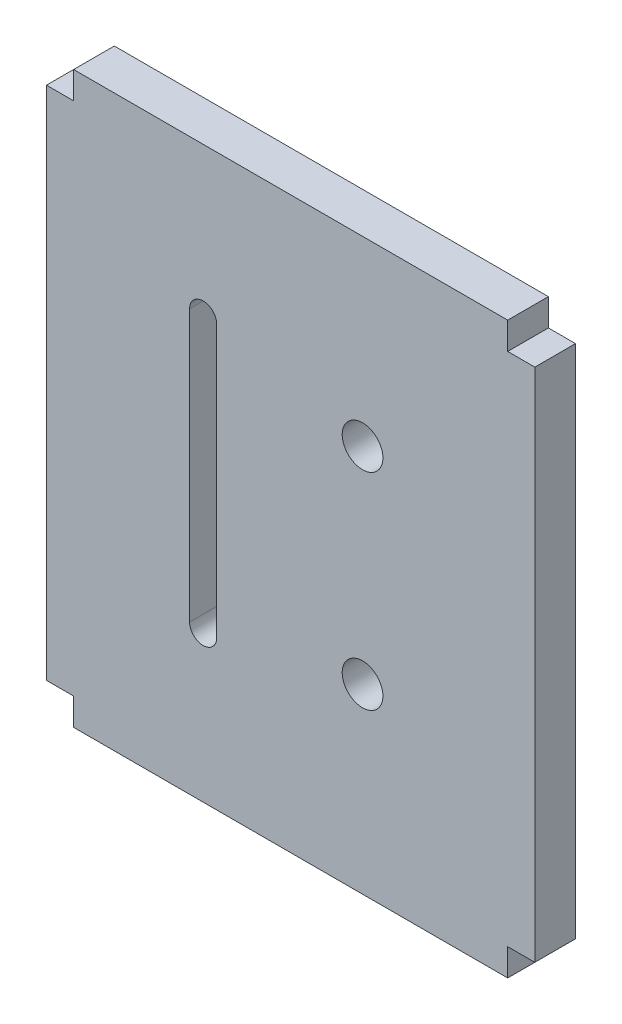
ISO-10303-21;
HEADER;
FILE_DESCRIPTION(('STEP AP214'),'2;1');
FILE_NAME('part.step','',(''),(''),'','','');
FILE_SCHEMA(('AUTOMOTIVE_DESIGN { 1 0 10303 214 1 1 1 1 }'));
ENDSEC;
DATA;
#1=APPLICATION_CONTEXT('core data for automotive mechanical design processes');
#2=APPLICATION_PROTOCOL_DEFINITION('international standard','automotive_design',2000,#1);
#3=PRODUCT_CONTEXT('',#1,'mechanical');
#4=PRODUCT('Part','Part','',(#3));
#5=PRODUCT_RELATED_PRODUCT_CATEGORY('part','',(#4));
#6=PRODUCT_DEFINITION_FORMATION('','',#4);
#7=PRODUCT_DEFINITION_CONTEXT('part definition',#1,'design');
#8=PRODUCT_DEFINITION('design','',#6,#7);
#9=PRODUCT_DEFINITION_SHAPE('','',#8);
#10=(LENGTH_UNIT() NAMED_UNIT(*) SI_UNIT(.MILLI.,.METRE.));
#11=(NAMED_UNIT(*) PLANE_ANGLE_UNIT() SI_UNIT($,.RADIAN.));
#12=(NAMED_UNIT(*) SI_UNIT($,.STERADIAN.) SOLID_ANGLE_UNIT());
#13=UNCERTAINTY_MEASURE_WITH_UNIT(LENGTH_MEASURE(1.E-05),#10,'distance_accuracy_value','');
#14=(GEOMETRIC_REPRESENTATION_CONTEXT(3) GLOBAL_UNCERTAINTY_ASSIGNED_CONTEXT((#13)) GLOBAL_UNIT_ASSIGNED_CONTEXT((#10,
#11,#12)) REPRESENTATION_CONTEXT('',''));
#15=CARTESIAN_POINT('',(0.,0.,0.));
#16=DIRECTION('',(0.,0.,1.));
#17=DIRECTION('',(1.,0.,0.));
#18=AXIS2_PLACEMENT_3D('',#15,#16,#17);
#19=CARTESIAN_POINT('',(-16.,0.,3.));
#20=DIRECTION('',(-1.,0.,0.));
#21=DIRECTION('',(0.,0.,1.));
#22=AXIS2_PLACEMENT_3D('',#19,#20,#21);
#23=PLANE('',#22);
#24=DIRECTION('',(0.,1.,0.));
#25=VECTOR('',#24,1.);
#26=CARTESIAN_POINT('',(-16.,0.,0.));
#27=LINE('',#26,#25);
#28=CARTESIAN_POINT('',(-16.,-21.,0.));
#29=VERTEX_POINT('',#28);
#30=CARTESIAN_POINT('',(-16.,-19.,0.));
#31=VERTEX_POINT('',#30);
#32=EDGE_CURVE('E218',#29,#31,#27,.T.);
#33=ORIENTED_EDGE('',*,*,#32,.F.);
#34=DIRECTION('',(0.,0.,-1.));
#35=VECTOR('',#34,1.);
#36=CARTESIAN_POINT('',(-16.,-21.,3.));
#37=LINE('',#36,#35);
#38=CARTESIAN_POINT('',(-16.,-21.,3.));
#39=VERTEX_POINT('',#38);
#40=EDGE_CURVE('E272',#39,#29,#37,.T.);
#41=ORIENTED_EDGE('',*,*,#40,.F.);
#42=DIRECTION('',(0.,1.,0.));
#43=VECTOR('',#42,1.);
#44=CARTESIAN_POINT('',(-16.,0.,3.));
#45=LINE('',#44,#43);
#46=CARTESIAN_POINT('',(-16.,-19.,3.));
#47=VERTEX_POINT('',#46);
#48=EDGE_CURVE('E187',#39,#47,#45,.T.);
#49=ORIENTED_EDGE('',*,*,#48,.T.);
#50=DIRECTION('',(0.,0.,-1.));
#51=VECTOR('',#50,1.);
#52=CARTESIAN_POINT('',(-16.,-19.,3.));
#53=LINE('',#52,#51);
#54=EDGE_CURVE('E217',#47,#31,#53,.T.);
#55=ORIENTED_EDGE('',*,*,#54,.T.);
#56=EDGE_LOOP('',(#33,#41,#49,#55));
#57=FACE_BOUND('',#56,.T.);
#58=ADVANCED_FACE('F39',(#57),#23,.T.);
#59=CARTESIAN_POINT('',(0.,-21.,3.));
#60=DIRECTION('',(0.,-1.,0.));
#61=DIRECTION('',(0.,0.,-1.));
#62=AXIS2_PLACEMENT_3D('',#59,#60,#61);
#63=PLANE('',#62);
#64=DIRECTION('',(-1.,0.,0.));
#65=VECTOR('',#64,1.);
#66=CARTESIAN_POINT('',(0.,-21.,0.));
#67=LINE('',#66,#65);
#68=CARTESIAN_POINT('',(16.,-21.,0.));
#69=VERTEX_POINT('',#68);
#70=EDGE_CURVE('E221',#69,#29,#67,.T.);
#71=ORIENTED_EDGE('',*,*,#70,.F.);
#72=DIRECTION('',(0.,0.,-1.));
#73=VECTOR('',#72,1.);
#74=CARTESIAN_POINT('',(16.,-21.,3.));
#75=LINE('',#74,#73);
#76=CARTESIAN_POINT('',(16.,-21.,3.));
#77=VERTEX_POINT('',#76);
#78=EDGE_CURVE('E270',#77,#69,#75,.T.);
#79=ORIENTED_EDGE('',*,*,#78,.F.);
#80=DIRECTION('',(-1.,0.,0.));
#81=VECTOR('',#80,1.);
#82=CARTESIAN_POINT('',(0.,-21.,3.));
#83=LINE('',#82,#81);
#84=EDGE_CURVE('E190',#77,#39,#83,.T.);
#85=ORIENTED_EDGE('',*,*,#84,.T.);
#86=ORIENTED_EDGE('',*,*,#40,.T.);
#87=EDGE_LOOP('',(#71,#79,#85,#86));
#88=FACE_BOUND('',#87,.T.);
#89=ADVANCED_FACE('F41',(#88),#63,.T.);
#90=CARTESIAN_POINT('',(16.,0.,3.));
#91=DIRECTION('',(-1.,0.,0.));
#92=DIRECTION('',(0.,0.,1.));
#93=AXIS2_PLACEMENT_3D('',#90,#91,#92);
#94=PLANE('',#93);
#95=DIRECTION('',(0.,1.,0.));
#96=VECTOR('',#95,1.);
#97=CARTESIAN_POINT('',(16.,0.,0.));
#98=LINE('',#97,#96);
#99=CARTESIAN_POINT('',(16.,-19.,0.));
#100=VERTEX_POINT('',#99);
#101=EDGE_CURVE('E225',#69,#100,#98,.T.);
#102=ORIENTED_EDGE('',*,*,#101,.T.);
#103=DIRECTION('',(0.,0.,-1.));
#104=VECTOR('',#103,1.);
#105=CARTESIAN_POINT('',(16.,-19.,3.));
#106=LINE('',#105,#104);
#107=CARTESIAN_POINT('',(16.,-19.,3.));
#108=VERTEX_POINT('',#107);
#109=EDGE_CURVE('E267',#108,#100,#106,.T.);
#110=ORIENTED_EDGE('',*,*,#109,.F.);
#111=DIRECTION('',(0.,1.,0.));
#112=VECTOR('',#111,1.);
#113=CARTESIAN_POINT('',(16.,0.,3.));
#114=LINE('',#113,#112);
#115=EDGE_CURVE('E196',#77,#108,#114,.T.);
#116=ORIENTED_EDGE('',*,*,#115,.F.);
#117=ORIENTED_EDGE('',*,*,#78,.T.);
#118=EDGE_LOOP('',(#102,#110,#116,#117));
#119=FACE_BOUND('',#118,.T.);
#120=ADVANCED_FACE('F305',(#119),#94,.F.);
#121=CARTESIAN_POINT('',(0.,-19.,3.));
#122=DIRECTION('',(0.,1.,0.));
#123=DIRECTION('',(0.,0.,1.));
#124=AXIS2_PLACEMENT_3D('',#121,#122,#123);
#125=PLANE('',#124);
#126=DIRECTION('',(1.,0.,0.));
#127=VECTOR('',#126,1.);
#128=CARTESIAN_POINT('',(0.,-19.,0.));
#129=LINE('',#128,#127);
#130=CARTESIAN_POINT('',(18.,-19.,0.));
#131=VERTEX_POINT('',#130);
#132=EDGE_CURVE('E227',#100,#131,#129,.T.);
#133=ORIENTED_EDGE('',*,*,#132,.T.);
#134=DIRECTION('',(0.,0.,-1.));
#135=VECTOR('',#134,1.);
#136=CARTESIAN_POINT('',(18.,-19.,3.));
#137=LINE('',#136,#135);
#138=CARTESIAN_POINT('',(18.,-19.,3.));
#139=VERTEX_POINT('',#138);
#140=EDGE_CURVE('E265',#139,#131,#137,.T.);
#141=ORIENTED_EDGE('',*,*,#140,.F.);
#142=DIRECTION('',(1.,0.,0.));
#143=VECTOR('',#142,1.);
#144=CARTESIAN_POINT('',(0.,-19.,3.));
#145=LINE('',#144,#143);
#146=EDGE_CURVE('E198',#108,#139,#145,.T.);
#147=ORIENTED_EDGE('',*,*,#146,.F.);
#148=ORIENTED_EDGE('',*,*,#109,.T.);
#149=EDGE_LOOP('',(#133,#141,#147,#148));
#150=FACE_BOUND('',#149,.T.);
#151=ADVANCED_FACE('F357',(#150),#125,.F.);
#152=CARTESIAN_POINT('',(18.,0.,3.));
#153=DIRECTION('',(1.,0.,0.));
#154=DIRECTION('',(0.,0.,-1.));
#155=AXIS2_PLACEMENT_3D('',#152,#153,#154);
#156=PLANE('',#155);
#157=DIRECTION('',(0.,-1.,0.));
#158=VECTOR('',#157,1.);
#159=CARTESIAN_POINT('',(18.,0.,0.));
#160=LINE('',#159,#158);
#161=CARTESIAN_POINT('',(18.,19.,0.));
#162=VERTEX_POINT('',#161);
#163=EDGE_CURVE('E231',#162,#131,#160,.T.);
#164=ORIENTED_EDGE('',*,*,#163,.F.);
#165=DIRECTION('',(0.,0.,-1.));
#166=VECTOR('',#165,1.);
#167=CARTESIAN_POINT('',(18.,19.,3.));
#168=LINE('',#167,#166);
#169=CARTESIAN_POINT('',(18.,19.,3.));
#170=VERTEX_POINT('',#169);
#171=EDGE_CURVE('E263',#170,#162,#168,.T.);
#172=ORIENTED_EDGE('',*,*,#171,.F.);
#173=DIRECTION('',(0.,-1.,0.));
#174=VECTOR('',#173,1.);
#175=CARTESIAN_POINT('',(18.,0.,3.));
#176=LINE('',#175,#174);
#177=EDGE_CURVE('E201',#170,#139,#176,.T.);
#178=ORIENTED_EDGE('',*,*,#177,.T.);
#179=ORIENTED_EDGE('',*,*,#140,.T.);
#180=EDGE_LOOP('',(#164,#172,#178,#179));
#181=FACE_BOUND('',#180,.T.);
#182=ADVANCED_FACE('F351',(#181),#156,.T.);
#183=CARTESIAN_POINT('',(0.,19.,3.));
#184=DIRECTION('',(0.,1.,0.));
#185=DIRECTION('',(0.,0.,1.));
#186=AXIS2_PLACEMENT_3D('',#183,#184,#185);
#187=PLANE('',#186);
#188=DIRECTION('',(1.,0.,0.));
#189=VECTOR('',#188,1.);
#190=CARTESIAN_POINT('',(0.,19.,0.));
#191=LINE('',#190,#189);
#192=CARTESIAN_POINT('',(16.,19.,0.));
#193=VERTEX_POINT('',#192);
#194=EDGE_CURVE('E235',#193,#162,#191,.T.);
#195=ORIENTED_EDGE('',*,*,#194,.F.);
#196=DIRECTION('',(0.,0.,-1.));
#197=VECTOR('',#196,1.);
#198=CARTESIAN_POINT('',(16.,19.,3.));
#199=LINE('',#198,#197);
#200=CARTESIAN_POINT('',(16.,19.,3.));
#201=VERTEX_POINT('',#200);
#202=EDGE_CURVE('E261',#201,#193,#199,.T.);
#203=ORIENTED_EDGE('',*,*,#202,.F.);
#204=DIRECTION('',(1.,0.,0.));
#205=VECTOR('',#204,1.);
#206=CARTESIAN_POINT('',(0.,19.,3.));
#207=LINE('',#206,#205);
#208=EDGE_CURVE('E204',#201,#170,#207,.T.);
#209=ORIENTED_EDGE('',*,*,#208,.T.);
#210=ORIENTED_EDGE('',*,*,#171,.T.);
#211=EDGE_LOOP('',(#195,#203,#209,#210));
#212=FACE_BOUND('',#211,.T.);
#213=ADVANCED_FACE('F347',(#212),#187,.T.);
#214=CARTESIAN_POINT('',(16.,21.,0.));
#215=VERTEX_POINT('',#214);
#216=EDGE_CURVE('E228',#193,#215,#98,.T.);
#217=ORIENTED_EDGE('',*,*,#216,.T.);
#218=DIRECTION('',(0.,0.,-1.));
#219=VECTOR('',#218,1.);
#220=CARTESIAN_POINT('',(16.,21.,3.));
#221=LINE('',#220,#219);
#222=CARTESIAN_POINT('',(16.,21.,3.));
#223=VERTEX_POINT('',#222);
#224=EDGE_CURVE('E258',#223,#215,#221,.T.);
#225=ORIENTED_EDGE('',*,*,#224,.F.);
#226=EDGE_CURVE('E199',#201,#223,#114,.T.);
#227=ORIENTED_EDGE('',*,*,#226,.F.);
#228=ORIENTED_EDGE('',*,*,#202,.T.);
#229=EDGE_LOOP('',(#217,#225,#227,#228));
#230=FACE_BOUND('',#229,.T.);
#231=ADVANCED_FACE('F320',(#230),#94,.F.);
#232=CARTESIAN_POINT('',(0.,21.,3.));
#233=DIRECTION('',(0.,-1.,0.));
#234=DIRECTION('',(0.,0.,-1.));
#235=AXIS2_PLACEMENT_3D('',#232,#233,#234);
#236=PLANE('',#235);
#237=DIRECTION('',(-1.,0.,0.));
#238=VECTOR('',#237,1.);
#239=CARTESIAN_POINT('',(0.,21.,0.));
#240=LINE('',#239,#238);
#241=CARTESIAN_POINT('',(-16.,21.,0.));
#242=VERTEX_POINT('',#241);
#243=EDGE_CURVE('E238',#215,#242,#240,.T.);
#244=ORIENTED_EDGE('',*,*,#243,.T.);
#245=DIRECTION('',(0.,0.,-1.));
#246=VECTOR('',#245,1.);
#247=CARTESIAN_POINT('',(-16.,21.,3.));
#248=LINE('',#247,#246);
#249=CARTESIAN_POINT('',(-16.,21.,3.));
#250=VERTEX_POINT('',#249);
#251=EDGE_CURVE('E256',#250,#242,#248,.T.);
#252=ORIENTED_EDGE('',*,*,#251,.F.);
#253=DIRECTION('',(-1.,0.,0.));
#254=VECTOR('',#253,1.);
#255=CARTESIAN_POINT('',(0.,21.,3.));
#256=LINE('',#255,#254);
#257=EDGE_CURVE('E207',#223,#250,#256,.T.);
#258=ORIENTED_EDGE('',*,*,#257,.F.);
#259=ORIENTED_EDGE('',*,*,#224,.T.);
#260=EDGE_LOOP('',(#244,#252,#258,#259));
#261=FACE_BOUND('',#260,.T.);
#262=ADVANCED_FACE('F312',(#261),#236,.F.);
#263=CARTESIAN_POINT('',(-16.,19.,0.));
#264=VERTEX_POINT('',#263);
#265=EDGE_CURVE('E222',#264,#242,#27,.T.);
#266=ORIENTED_EDGE('',*,*,#265,.F.);
#267=DIRECTION('',(0.,0.,-1.));
#268=VECTOR('',#267,1.);
#269=CARTESIAN_POINT('',(-16.,19.,3.));
#270=LINE('',#269,#268);
#271=CARTESIAN_POINT('',(-16.,19.,3.));
#272=VERTEX_POINT('',#271);
#273=EDGE_CURVE('E254',#272,#264,#270,.T.);
#274=ORIENTED_EDGE('',*,*,#273,.F.);
#275=EDGE_CURVE('E192',#272,#250,#45,.T.);
#276=ORIENTED_EDGE('',*,*,#275,.T.);
#277=ORIENTED_EDGE('',*,*,#251,.T.);
#278=EDGE_LOOP('',(#266,#274,#276,#277));
#279=FACE_BOUND('',#278,.T.);
#280=ADVANCED_FACE('F301',(#279),#23,.T.);
#281=CARTESIAN_POINT('',(0.,19.,3.));
#282=DIRECTION('',(0.,-1.,0.));
#283=DIRECTION('',(0.,0.,-1.));
#284=AXIS2_PLACEMENT_3D('',#281,#282,#283);
#285=PLANE('',#284);
#286=DIRECTION('',(-1.,0.,0.));
#287=VECTOR('',#286,1.);
#288=CARTESIAN_POINT('',(0.,19.,0.));
#289=LINE('',#288,#287);
#290=CARTESIAN_POINT('',(-18.,19.,0.));
#291=VERTEX_POINT('',#290);
#292=EDGE_CURVE('E241',#264,#291,#289,.T.);
#293=ORIENTED_EDGE('',*,*,#292,.T.);
#294=DIRECTION('',(0.,0.,-1.));
#295=VECTOR('',#294,1.);
#296=CARTESIAN_POINT('',(-18.,19.,3.));
#297=LINE('',#296,#295);
#298=CARTESIAN_POINT('',(-18.,19.,3.));
#299=VERTEX_POINT('',#298);
#300=EDGE_CURVE('E251',#299,#291,#297,.T.);
#301=ORIENTED_EDGE('',*,*,#300,.F.);
#302=DIRECTION('',(-1.,0.,0.));
#303=VECTOR('',#302,1.);
#304=CARTESIAN_POINT('',(0.,19.,3.));
#305=LINE('',#304,#303);
#306=EDGE_CURVE('E210',#272,#299,#305,.T.);
#307=ORIENTED_EDGE('',*,*,#306,.F.);
#308=ORIENTED_EDGE('',*,*,#273,.T.);
#309=EDGE_LOOP('',(#293,#301,#307,#308));
#310=FACE_BOUND('',#309,.T.);
#311=ADVANCED_FACE('F311',(#310),#285,.F.);
#312=CARTESIAN_POINT('',(-18.,0.,3.));
#313=DIRECTION('',(1.,0.,0.));
#314=DIRECTION('',(0.,0.,-1.));
#315=AXIS2_PLACEMENT_3D('',#312,#313,#314);
#316=PLANE('',#315);
#317=DIRECTION('',(0.,-1.,0.));
#318=VECTOR('',#317,1.);
#319=CARTESIAN_POINT('',(-18.,0.,0.));
#320=LINE('',#319,#318);
#321=CARTESIAN_POINT('',(-18.,-19.,0.));
#322=VERTEX_POINT('',#321);
#323=EDGE_CURVE('E243',#291,#322,#320,.T.);
#324=ORIENTED_EDGE('',*,*,#323,.T.);
#325=DIRECTION('',(0.,0.,-1.));
#326=VECTOR('',#325,1.);
#327=CARTESIAN_POINT('',(-18.,-19.,3.));
#328=LINE('',#327,#326);
#329=CARTESIAN_POINT('',(-18.,-19.,3.));
#330=VERTEX_POINT('',#329);
#331=EDGE_CURVE('E249',#330,#322,#328,.T.);
#332=ORIENTED_EDGE('',*,*,#331,.F.);
#333=DIRECTION('',(0.,-1.,0.));
#334=VECTOR('',#333,1.);
#335=CARTESIAN_POINT('',(-18.,0.,3.));
#336=LINE('',#335,#334);
#337=EDGE_CURVE('E212',#299,#330,#336,.T.);
#338=ORIENTED_EDGE('',*,*,#337,.F.);
#339=ORIENTED_EDGE('',*,*,#300,.T.);
#340=EDGE_LOOP('',(#324,#332,#338,#339));
#341=FACE_BOUND('',#340,.T.);
#342=ADVANCED_FACE('F318',(#341),#316,.F.);
#343=CARTESIAN_POINT('',(0.,-19.,3.));
#344=DIRECTION('',(0.,-1.,0.));
#345=DIRECTION('',(0.,0.,-1.));
#346=AXIS2_PLACEMENT_3D('',#343,#344,#345);
#347=PLANE('',#346);
#348=DIRECTION('',(-1.,0.,0.));
#349=VECTOR('',#348,1.);
#350=CARTESIAN_POINT('',(0.,-19.,0.));
#351=LINE('',#350,#349);
#352=EDGE_CURVE('E191',#31,#322,#351,.T.);
#353=ORIENTED_EDGE('',*,*,#352,.F.);
#354=ORIENTED_EDGE('',*,*,#54,.F.);
#355=DIRECTION('',(-1.,0.,0.));
#356=VECTOR('',#355,1.);
#357=CARTESIAN_POINT('',(0.,-19.,3.));
#358=LINE('',#357,#356);
#359=EDGE_CURVE('E214',#47,#330,#358,.T.);
#360=ORIENTED_EDGE('',*,*,#359,.T.);
#361=ORIENTED_EDGE('',*,*,#331,.T.);
#362=EDGE_LOOP('',(#353,#354,#360,#361));
#363=FACE_BOUND('',#362,.T.);
#364=ADVANCED_FACE('F365',(#363),#347,.T.);
#365=CARTESIAN_POINT('',(0.,0.,3.));
#366=DIRECTION('',(0.,0.,1.));
#367=DIRECTION('',(1.,0.,0.));
#368=AXIS2_PLACEMENT_3D('',#365,#366,#367);
#369=PLANE('',#368);
#370=CARTESIAN_POINT('',(5.3,7.59999999999999,3.));
#371=DIRECTION('',(0.,0.,1.));
#372=DIRECTION('',(1.,0.,0.));
#373=AXIS2_PLACEMENT_3D('',#370,#371,#372);
#374=CIRCLE('',#373,1.5);
#375=CARTESIAN_POINT('',(6.8,7.59999999999999,3.));
#376=VERTEX_POINT('',#375);
#377=EDGE_CURVE('E180',#376,#376,#374,.T.);
#378=ORIENTED_EDGE('',*,*,#377,.F.);
#379=EDGE_LOOP('',(#378));
#380=FACE_BOUND('',#379,.T.);
#381=CARTESIAN_POINT('',(-6.45,-10.,3.));
#382=DIRECTION('',(0.,0.,1.));
#383=DIRECTION('',(1.,0.,0.));
#384=AXIS2_PLACEMENT_3D('',#381,#382,#383);
#385=CIRCLE('',#384,1.);
#386=CARTESIAN_POINT('',(-7.45,-10.,3.));
#387=VERTEX_POINT('',#386);
#388=CARTESIAN_POINT('',(-5.45,-10.,3.));
#389=VERTEX_POINT('',#388);
#390=EDGE_CURVE('E55',#387,#389,#385,.T.);
#391=ORIENTED_EDGE('',*,*,#390,.F.);
#392=DIRECTION('',(0.,-1.,0.));
#393=VECTOR('',#392,1.);
#394=CARTESIAN_POINT('',(-7.45,-10.,3.));
#395=LINE('',#394,#393);
#396=CARTESIAN_POINT('',(-7.45,10.,3.));
#397=VERTEX_POINT('',#396);
#398=EDGE_CURVE('E172',#397,#387,#395,.T.);
#399=ORIENTED_EDGE('',*,*,#398,.F.);
#400=CARTESIAN_POINT('',(-6.45,10.,3.));
#401=DIRECTION('',(0.,0.,1.));
#402=DIRECTION('',(1.,0.,0.));
#403=AXIS2_PLACEMENT_3D('',#400,#401,#402);
#404=CIRCLE('',#403,1.);
#405=CARTESIAN_POINT('',(-5.45,10.,3.));
#406=VERTEX_POINT('',#405);
#407=EDGE_CURVE('E156',#406,#397,#404,.T.);
#408=ORIENTED_EDGE('',*,*,#407,.F.);
#409=DIRECTION('',(0.,1.,0.));
#410=VECTOR('',#409,1.);
#411=CARTESIAN_POINT('',(-5.45,-10.,3.));
#412=LINE('',#411,#410);
#413=EDGE_CURVE('E165',#389,#406,#412,.T.);
#414=ORIENTED_EDGE('',*,*,#413,.F.);
#415=EDGE_LOOP('',(#391,#399,#408,#414));
#416=FACE_BOUND('',#415,.T.);
#417=CARTESIAN_POINT('',(5.3,-7.60000000000001,3.));
#418=DIRECTION('',(0.,0.,1.));
#419=DIRECTION('',(1.,0.,0.));
#420=AXIS2_PLACEMENT_3D('',#417,#418,#419);
#421=CIRCLE('',#420,1.5);
#422=CARTESIAN_POINT('',(6.8,-7.60000000000001,3.));
#423=VERTEX_POINT('',#422);
#424=EDGE_CURVE('E183',#423,#423,#421,.T.);
#425=ORIENTED_EDGE('',*,*,#424,.F.);
#426=EDGE_LOOP('',(#425));
#427=FACE_BOUND('',#426,.T.);
#428=ORIENTED_EDGE('',*,*,#48,.F.);
#429=ORIENTED_EDGE('',*,*,#84,.F.);
#430=ORIENTED_EDGE('',*,*,#115,.T.);
#431=ORIENTED_EDGE('',*,*,#146,.T.);
#432=ORIENTED_EDGE('',*,*,#177,.F.);
#433=ORIENTED_EDGE('',*,*,#208,.F.);
#434=ORIENTED_EDGE('',*,*,#226,.T.);
#435=ORIENTED_EDGE('',*,*,#257,.T.);
#436=ORIENTED_EDGE('',*,*,#275,.F.);
#437=ORIENTED_EDGE('',*,*,#306,.T.);
#438=ORIENTED_EDGE('',*,*,#337,.T.);
#439=ORIENTED_EDGE('',*,*,#359,.F.);
#440=EDGE_LOOP('',(#428,#429,#430,#431,#432,#433,#434,#435,#436,#437,#438,#439));
#441=FACE_BOUND('',#440,.T.);
#442=ADVANCED_FACE('F169',(#380,#416,#427,#441),#369,.T.);
#443=CARTESIAN_POINT('',(0.,0.,0.));
#444=DIRECTION('',(0.,0.,1.));
#445=DIRECTION('',(1.,0.,0.));
#446=AXIS2_PLACEMENT_3D('',#443,#444,#445);
#447=PLANE('',#446);
#448=CARTESIAN_POINT('',(5.3,7.59999999999999,0.));
#449=DIRECTION('',(0.,0.,1.));
#450=DIRECTION('',(1.,0.,0.));
#451=AXIS2_PLACEMENT_3D('',#448,#449,#450);
#452=CIRCLE('',#451,1.5);
#453=CARTESIAN_POINT('',(6.8,7.59999999999999,0.));
#454=VERTEX_POINT('',#453);
#455=EDGE_CURVE('E43',#454,#454,#452,.T.);
#456=ORIENTED_EDGE('',*,*,#455,.T.);
#457=EDGE_LOOP('',(#456));
#458=FACE_BOUND('',#457,.T.);
#459=DIRECTION('',(0.,-1.,0.));
#460=VECTOR('',#459,1.);
#461=CARTESIAN_POINT('',(-7.45,0.,0.));
#462=LINE('',#461,#460);
#463=CARTESIAN_POINT('',(-7.45,10.,0.));
#464=VERTEX_POINT('',#463);
#465=CARTESIAN_POINT('',(-7.45,-10.,0.));
#466=VERTEX_POINT('',#465);
#467=EDGE_CURVE('E48',#464,#466,#462,.T.);
#468=ORIENTED_EDGE('',*,*,#467,.T.);
#469=CARTESIAN_POINT('',(-6.45,-10.,0.));
#470=DIRECTION('',(0.,0.,1.));
#471=DIRECTION('',(1.,0.,0.));
#472=AXIS2_PLACEMENT_3D('',#469,#470,#471);
#473=CIRCLE('',#472,1.);
#474=CARTESIAN_POINT('',(-5.45,-10.,0.));
#475=VERTEX_POINT('',#474);
#476=EDGE_CURVE('E11',#466,#475,#473,.T.);
#477=ORIENTED_EDGE('',*,*,#476,.T.);
#478=DIRECTION('',(0.,1.,0.));
#479=VECTOR('',#478,1.);
#480=CARTESIAN_POINT('',(-5.45,0.,0.));
#481=LINE('',#480,#479);
#482=CARTESIAN_POINT('',(-5.45,10.,0.));
#483=VERTEX_POINT('',#482);
#484=EDGE_CURVE('E274',#475,#483,#481,.T.);
#485=ORIENTED_EDGE('',*,*,#484,.T.);
#486=CARTESIAN_POINT('',(-6.45,10.,0.));
#487=DIRECTION('',(0.,0.,1.));
#488=DIRECTION('',(1.,0.,0.));
#489=AXIS2_PLACEMENT_3D('',#486,#487,#488);
#490=CIRCLE('',#489,1.);
#491=EDGE_CURVE('E159',#483,#464,#490,.T.);
#492=ORIENTED_EDGE('',*,*,#491,.T.);
#493=EDGE_LOOP('',(#468,#477,#485,#492));
#494=FACE_BOUND('',#493,.T.);
#495=CARTESIAN_POINT('',(5.3,-7.60000000000001,0.));
#496=DIRECTION('',(0.,0.,1.));
#497=DIRECTION('',(1.,0.,0.));
#498=AXIS2_PLACEMENT_3D('',#495,#496,#497);
#499=CIRCLE('',#498,1.5);
#500=CARTESIAN_POINT('',(6.8,-7.60000000000001,0.));
#501=VERTEX_POINT('',#500);
#502=EDGE_CURVE('E186',#501,#501,#499,.T.);
#503=ORIENTED_EDGE('',*,*,#502,.T.);
#504=EDGE_LOOP('',(#503));
#505=FACE_BOUND('',#504,.T.);
#506=ORIENTED_EDGE('',*,*,#32,.T.);
#507=ORIENTED_EDGE('',*,*,#352,.T.);
#508=ORIENTED_EDGE('',*,*,#323,.F.);
#509=ORIENTED_EDGE('',*,*,#292,.F.);
#510=ORIENTED_EDGE('',*,*,#265,.T.);
#511=ORIENTED_EDGE('',*,*,#243,.F.);
#512=ORIENTED_EDGE('',*,*,#216,.F.);
#513=ORIENTED_EDGE('',*,*,#194,.T.);
#514=ORIENTED_EDGE('',*,*,#163,.T.);
#515=ORIENTED_EDGE('',*,*,#132,.F.);
#516=ORIENTED_EDGE('',*,*,#101,.F.);
#517=ORIENTED_EDGE('',*,*,#70,.T.);
#518=EDGE_LOOP('',(#506,#507,#508,#509,#510,#511,#512,#513,#514,#515,#516,#517));
#519=FACE_BOUND('',#518,.T.);
#520=ADVANCED_FACE('F281',(#458,#494,#505,#519),#447,.F.);
#521=CARTESIAN_POINT('',(5.3,-7.60000000000001,-7.));
#522=DIRECTION('',(0.,0.,1.));
#523=DIRECTION('',(1.,0.,0.));
#524=AXIS2_PLACEMENT_3D('',#521,#522,#523);
#525=CYLINDRICAL_SURFACE('',#524,1.5);
#526=ORIENTED_EDGE('',*,*,#424,.T.);
#527=EDGE_LOOP('',(#526));
#528=FACE_BOUND('',#527,.T.);
#529=ORIENTED_EDGE('',*,*,#502,.F.);
#530=EDGE_LOOP('',(#529));
#531=FACE_BOUND('',#530,.T.);
#532=ADVANCED_FACE('F288',(#528,#531),#525,.F.);
#533=CARTESIAN_POINT('',(-6.45,-10.,-7.));
#534=DIRECTION('',(0.,0.,1.));
#535=DIRECTION('',(1.,0.,0.));
#536=AXIS2_PLACEMENT_3D('',#533,#534,#535);
#537=CYLINDRICAL_SURFACE('',#536,1.);
#538=DIRECTION('',(0.,0.,1.));
#539=VECTOR('',#538,1.);
#540=CARTESIAN_POINT('',(-7.45,-10.,-7.));
#541=LINE('',#540,#539);
#542=EDGE_CURVE('E178',#466,#387,#541,.T.);
#543=ORIENTED_EDGE('',*,*,#542,.T.);
#544=ORIENTED_EDGE('',*,*,#390,.T.);
#545=DIRECTION('',(0.,0.,1.));
#546=VECTOR('',#545,1.);
#547=CARTESIAN_POINT('',(-5.45,-10.,-7.));
#548=LINE('',#547,#546);
#549=EDGE_CURVE('E162',#475,#389,#548,.T.);
#550=ORIENTED_EDGE('',*,*,#549,.F.);
#551=ORIENTED_EDGE('',*,*,#476,.F.);
#552=EDGE_LOOP('',(#543,#544,#550,#551));
#553=FACE_BOUND('',#552,.T.);
#554=ADVANCED_FACE('F286',(#553),#537,.F.);
#555=CARTESIAN_POINT('',(-7.45,-10.,-7.));
#556=DIRECTION('',(-1.,0.,0.));
#557=DIRECTION('',(0.,-1.,0.));
#558=AXIS2_PLACEMENT_3D('',#555,#556,#557);
#559=PLANE('',#558);
#560=DIRECTION('',(0.,0.,1.));
#561=VECTOR('',#560,1.);
#562=CARTESIAN_POINT('',(-7.45,10.,-7.));
#563=LINE('',#562,#561);
#564=EDGE_CURVE('E161',#464,#397,#563,.T.);
#565=ORIENTED_EDGE('',*,*,#564,.T.);
#566=ORIENTED_EDGE('',*,*,#398,.T.);
#567=ORIENTED_EDGE('',*,*,#542,.F.);
#568=ORIENTED_EDGE('',*,*,#467,.F.);
#569=EDGE_LOOP('',(#565,#566,#567,#568));
#570=FACE_BOUND('',#569,.T.);
#571=ADVANCED_FACE('F285',(#570),#559,.F.);
#572=CARTESIAN_POINT('',(-6.45,10.,-7.));
#573=DIRECTION('',(0.,0.,1.));
#574=DIRECTION('',(1.,0.,0.));
#575=AXIS2_PLACEMENT_3D('',#572,#573,#574);
#576=CYLINDRICAL_SURFACE('',#575,1.);
#577=DIRECTION('',(0.,0.,1.));
#578=VECTOR('',#577,1.);
#579=CARTESIAN_POINT('',(-5.45,10.,-7.));
#580=LINE('',#579,#578);
#581=EDGE_CURVE('E63',#483,#406,#580,.T.);
#582=ORIENTED_EDGE('',*,*,#581,.T.);
#583=ORIENTED_EDGE('',*,*,#407,.T.);
#584=ORIENTED_EDGE('',*,*,#564,.F.);
#585=ORIENTED_EDGE('',*,*,#491,.F.);
#586=EDGE_LOOP('',(#582,#583,#584,#585));
#587=FACE_BOUND('',#586,.T.);
#588=ADVANCED_FACE('F153',(#587),#576,.F.);
#589=CARTESIAN_POINT('',(-5.45,-10.,-7.));
#590=DIRECTION('',(1.,0.,0.));
#591=DIRECTION('',(0.,0.,-1.));
#592=AXIS2_PLACEMENT_3D('',#589,#590,#591);
#593=PLANE('',#592);
#594=ORIENTED_EDGE('',*,*,#549,.T.);
#595=ORIENTED_EDGE('',*,*,#413,.T.);
#596=ORIENTED_EDGE('',*,*,#581,.F.);
#597=ORIENTED_EDGE('',*,*,#484,.F.);
#598=EDGE_LOOP('',(#594,#595,#596,#597));
#599=FACE_BOUND('',#598,.T.);
#600=ADVANCED_FACE('F166',(#599),#593,.F.);
#601=CARTESIAN_POINT('',(5.3,7.59999999999999,-7.));
#602=DIRECTION('',(0.,0.,1.));
#603=DIRECTION('',(1.,0.,0.));
#604=AXIS2_PLACEMENT_3D('',#601,#602,#603);
#605=CYLINDRICAL_SURFACE('',#604,1.5);
#606=ORIENTED_EDGE('',*,*,#377,.T.);
#607=EDGE_LOOP('',(#606));
#608=FACE_BOUND('',#607,.T.);
#609=ORIENTED_EDGE('',*,*,#455,.F.);
#610=EDGE_LOOP('',(#609));
#611=FACE_BOUND('',#610,.T.);
#612=ADVANCED_FACE('F387',(#608,#611),#605,.F.);
#613=CLOSED_SHELL('',(#58,#89,#120,#151,#182,#213,#231,#262,#280,#311,#342,#364,#442,#520,#532,
#554,#571,#588,#600,#612));
#614=MANIFOLD_SOLID_BREP('B2',#613);
#615=ADVANCED_BREP_SHAPE_REPRESENTATION('',(#18,#614),#14);
#616=SHAPE_DEFINITION_REPRESENTATION(#9,#615);
ENDSEC;
END-ISO-10303-21;
